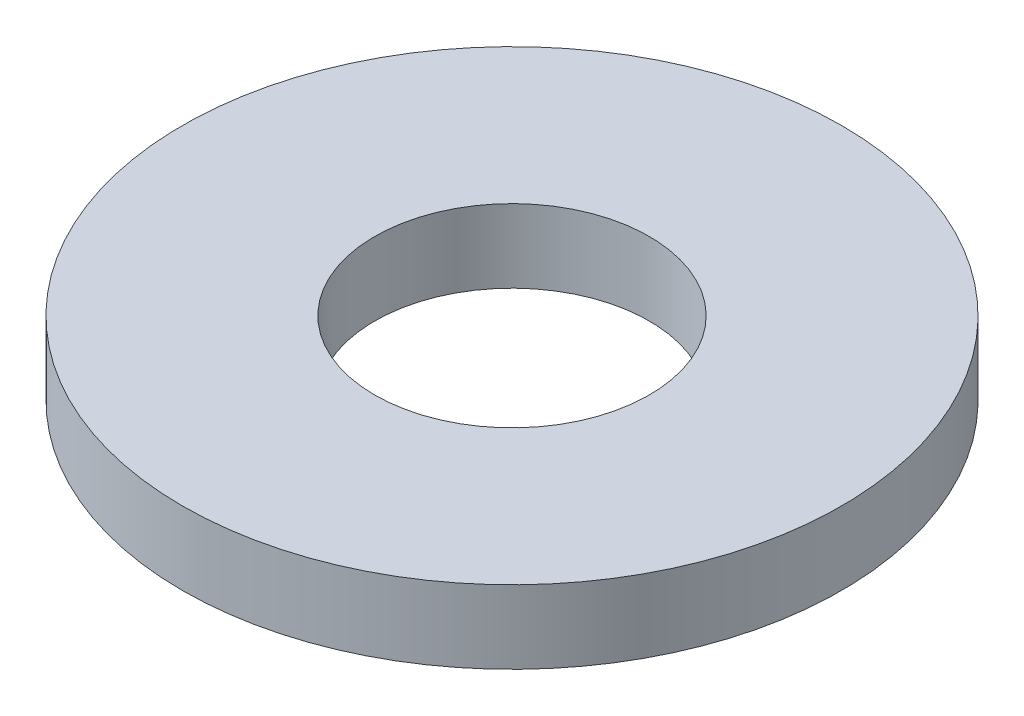
ISO-10303-21;
HEADER;
FILE_DESCRIPTION(('STEP AP214'),'2;1');
FILE_NAME('part.step','',(''),(''),'','','');
FILE_SCHEMA(('AUTOMOTIVE_DESIGN { 1 0 10303 214 1 1 1 1 }'));
ENDSEC;
DATA;
#1=APPLICATION_CONTEXT('core data for automotive mechanical design processes');
#2=APPLICATION_PROTOCOL_DEFINITION('international standard','automotive_design',2000,#1);
#3=PRODUCT_CONTEXT('',#1,'mechanical');
#4=PRODUCT('Part','Part','',(#3));
#5=PRODUCT_RELATED_PRODUCT_CATEGORY('part','',(#4));
#6=PRODUCT_DEFINITION_FORMATION('','',#4);
#7=PRODUCT_DEFINITION_CONTEXT('part definition',#1,'design');
#8=PRODUCT_DEFINITION('design','',#6,#7);
#9=PRODUCT_DEFINITION_SHAPE('','',#8);
#10=(LENGTH_UNIT() NAMED_UNIT(*) SI_UNIT(.MILLI.,.METRE.));
#11=(NAMED_UNIT(*) PLANE_ANGLE_UNIT() SI_UNIT($,.RADIAN.));
#12=(NAMED_UNIT(*) SI_UNIT($,.STERADIAN.) SOLID_ANGLE_UNIT());
#13=UNCERTAINTY_MEASURE_WITH_UNIT(LENGTH_MEASURE(1.E-05),#10,'distance_accuracy_value','');
#14=(GEOMETRIC_REPRESENTATION_CONTEXT(3) GLOBAL_UNCERTAINTY_ASSIGNED_CONTEXT((#13)) GLOBAL_UNIT_ASSIGNED_CONTEXT((#10,
#11,#12)) REPRESENTATION_CONTEXT('',''));
#15=CARTESIAN_POINT('',(0.,0.,0.));
#16=DIRECTION('',(0.,0.,1.));
#17=DIRECTION('',(1.,0.,0.));
#18=AXIS2_PLACEMENT_3D('',#15,#16,#17);
#19=CARTESIAN_POINT('',(0.,20.,0.));
#20=DIRECTION('',(0.,-1.,0.));
#21=DIRECTION('',(0.,0.,-1.));
#22=AXIS2_PLACEMENT_3D('',#19,#20,#21);
#23=CYLINDRICAL_SURFACE('',#22,90.);
#24=CARTESIAN_POINT('',(0.,20.,0.));
#25=DIRECTION('',(0.,1.,0.));
#26=DIRECTION('',(0.,0.,1.));
#27=AXIS2_PLACEMENT_3D('',#24,#25,#26);
#28=CIRCLE('',#27,90.);
#29=CARTESIAN_POINT('',(0.,20.,90.));
#30=VERTEX_POINT('',#29);
#31=EDGE_CURVE('E10',#30,#30,#28,.T.);
#32=ORIENTED_EDGE('',*,*,#31,.F.);
#33=EDGE_LOOP('',(#32));
#34=FACE_BOUND('',#33,.T.);
#35=CARTESIAN_POINT('',(0.,0.,0.));
#36=DIRECTION('',(0.,1.,0.));
#37=DIRECTION('',(0.,0.,1.));
#38=AXIS2_PLACEMENT_3D('',#35,#36,#37);
#39=CIRCLE('',#38,90.);
#40=CARTESIAN_POINT('',(0.,0.,90.));
#41=VERTEX_POINT('',#40);
#42=EDGE_CURVE('E37',#41,#41,#39,.T.);
#43=ORIENTED_EDGE('',*,*,#42,.T.);
#44=EDGE_LOOP('',(#43));
#45=FACE_BOUND('',#44,.T.);
#46=ADVANCED_FACE('F40',(#34,#45),#23,.T.);
#47=CARTESIAN_POINT('',(0.,20.,0.));
#48=DIRECTION('',(0.,1.,0.));
#49=DIRECTION('',(0.,0.,1.));
#50=AXIS2_PLACEMENT_3D('',#47,#48,#49);
#51=PLANE('',#50);
#52=CARTESIAN_POINT('',(0.,20.,0.));
#53=DIRECTION('',(0.,1.,0.));
#54=DIRECTION('',(0.,0.,1.));
#55=AXIS2_PLACEMENT_3D('',#52,#53,#54);
#56=CIRCLE('',#55,37.5);
#57=CARTESIAN_POINT('',(0.,20.,37.5));
#58=VERTEX_POINT('',#57);
#59=EDGE_CURVE('E50',#58,#58,#56,.T.);
#60=ORIENTED_EDGE('',*,*,#59,.F.);
#61=EDGE_LOOP('',(#60));
#62=FACE_BOUND('',#61,.T.);
#63=ORIENTED_EDGE('',*,*,#31,.T.);
#64=EDGE_LOOP('',(#63));
#65=FACE_BOUND('',#64,.T.);
#66=ADVANCED_FACE('F59',(#62,#65),#51,.T.);
#67=CARTESIAN_POINT('',(0.,0.,0.));
#68=DIRECTION('',(0.,1.,0.));
#69=DIRECTION('',(0.,0.,1.));
#70=AXIS2_PLACEMENT_3D('',#67,#68,#69);
#71=PLANE('',#70);
#72=CARTESIAN_POINT('',(0.,0.,0.));
#73=DIRECTION('',(0.,1.,0.));
#74=DIRECTION('',(0.,0.,1.));
#75=AXIS2_PLACEMENT_3D('',#72,#73,#74);
#76=CIRCLE('',#75,37.5);
#77=CARTESIAN_POINT('',(0.,0.,37.5));
#78=VERTEX_POINT('',#77);
#79=EDGE_CURVE('E47',#78,#78,#76,.T.);
#80=ORIENTED_EDGE('',*,*,#79,.T.);
#81=EDGE_LOOP('',(#80));
#82=FACE_BOUND('',#81,.T.);
#83=ORIENTED_EDGE('',*,*,#42,.F.);
#84=EDGE_LOOP('',(#83));
#85=FACE_BOUND('',#84,.T.);
#86=ADVANCED_FACE('F58',(#82,#85),#71,.F.);
#87=CARTESIAN_POINT('',(0.,20.,0.));
#88=DIRECTION('',(0.,-1.,0.));
#89=DIRECTION('',(0.,0.,-1.));
#90=AXIS2_PLACEMENT_3D('',#87,#88,#89);
#91=CYLINDRICAL_SURFACE('',#90,37.5);
#92=ORIENTED_EDGE('',*,*,#59,.T.);
#93=EDGE_LOOP('',(#92));
#94=FACE_BOUND('',#93,.T.);
#95=ORIENTED_EDGE('',*,*,#79,.F.);
#96=EDGE_LOOP('',(#95));
#97=FACE_BOUND('',#96,.T.);
#98=ADVANCED_FACE('F54',(#94,#97),#91,.F.);
#99=CLOSED_SHELL('',(#46,#66,#86,#98));
#100=MANIFOLD_SOLID_BREP('B2',#99);
#101=ADVANCED_BREP_SHAPE_REPRESENTATION('',(#18,#100),#14);
#102=SHAPE_DEFINITION_REPRESENTATION(#9,#101);
ENDSEC;
END-ISO-10303-21;
